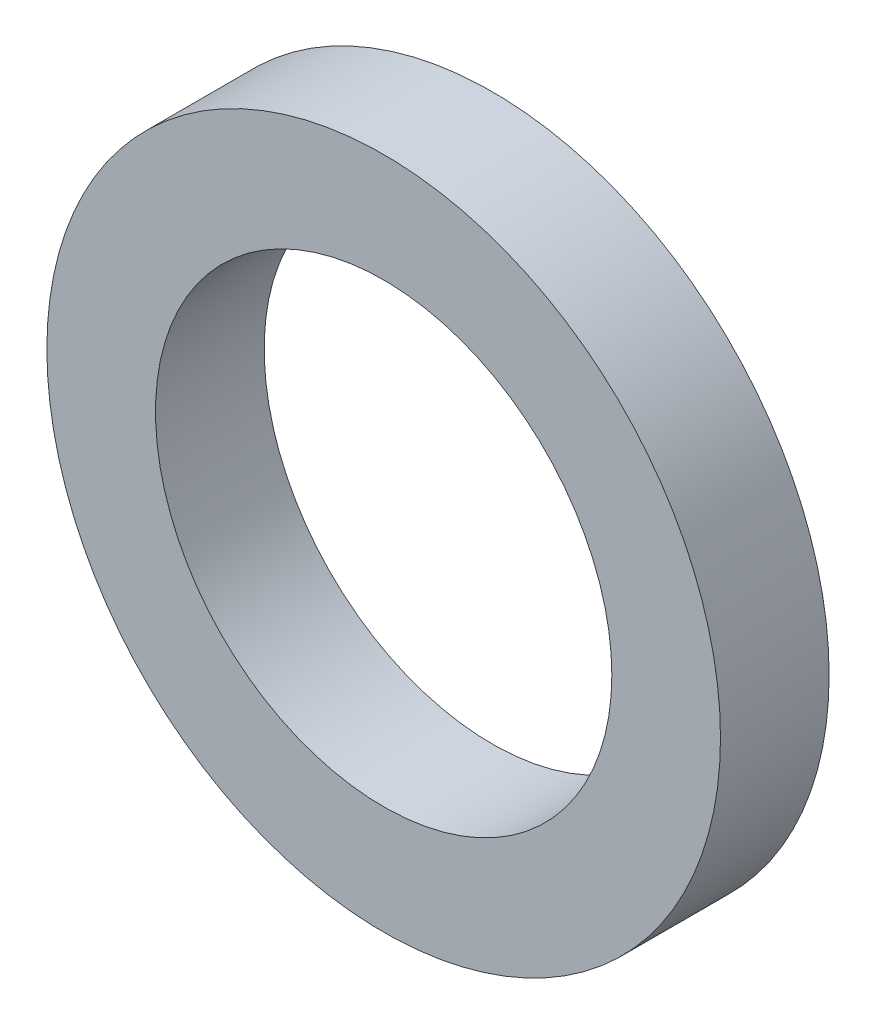
ISO-10303-21;
HEADER;
FILE_DESCRIPTION(('STEP AP214'),'2;1');
FILE_NAME('part.step','',(''),(''),'','','');
FILE_SCHEMA(('AUTOMOTIVE_DESIGN { 1 0 10303 214 1 1 1 1 }'));
ENDSEC;
DATA;
#1=APPLICATION_CONTEXT('core data for automotive mechanical design processes');
#2=APPLICATION_PROTOCOL_DEFINITION('international standard','automotive_design',2000,#1);
#3=PRODUCT_CONTEXT('',#1,'mechanical');
#4=PRODUCT('Part','Part','',(#3));
#5=PRODUCT_RELATED_PRODUCT_CATEGORY('part','',(#4));
#6=PRODUCT_DEFINITION_FORMATION('','',#4);
#7=PRODUCT_DEFINITION_CONTEXT('part definition',#1,'design');
#8=PRODUCT_DEFINITION('design','',#6,#7);
#9=PRODUCT_DEFINITION_SHAPE('','',#8);
#10=(LENGTH_UNIT() NAMED_UNIT(*) SI_UNIT(.MILLI.,.METRE.));
#11=(NAMED_UNIT(*) PLANE_ANGLE_UNIT() SI_UNIT($,.RADIAN.));
#12=(NAMED_UNIT(*) SI_UNIT($,.STERADIAN.) SOLID_ANGLE_UNIT());
#13=UNCERTAINTY_MEASURE_WITH_UNIT(LENGTH_MEASURE(1.E-05),#10,'distance_accuracy_value','');
#14=(GEOMETRIC_REPRESENTATION_CONTEXT(3) GLOBAL_UNCERTAINTY_ASSIGNED_CONTEXT((#13)) GLOBAL_UNIT_ASSIGNED_CONTEXT((#10,
#11,#12)) REPRESENTATION_CONTEXT('',''));
#15=CARTESIAN_POINT('',(0.,0.,0.));
#16=DIRECTION('',(0.,0.,1.));
#17=DIRECTION('',(1.,0.,0.));
#18=AXIS2_PLACEMENT_3D('',#15,#16,#17);
#19=CARTESIAN_POINT('',(0.,0.,1.));
#20=DIRECTION('',(0.,0.,1.));
#21=DIRECTION('',(1.,0.,0.));
#22=AXIS2_PLACEMENT_3D('',#19,#20,#21);
#23=PLANE('',#22);
#24=CARTESIAN_POINT('',(0.,0.,1.));
#25=DIRECTION('',(0.,0.,1.));
#26=DIRECTION('',(1.,0.,0.));
#27=AXIS2_PLACEMENT_3D('',#24,#25,#26);
#28=CIRCLE('',#27,3.1);
#29=CARTESIAN_POINT('',(3.1,0.,1.));
#30=VERTEX_POINT('',#29);
#31=EDGE_CURVE('E10',#30,#30,#28,.T.);
#32=ORIENTED_EDGE('',*,*,#31,.T.);
#33=EDGE_LOOP('',(#32));
#34=FACE_BOUND('',#33,.T.);
#35=CARTESIAN_POINT('',(0.,0.,1.));
#36=DIRECTION('',(0.,0.,1.));
#37=DIRECTION('',(1.,0.,0.));
#38=AXIS2_PLACEMENT_3D('',#35,#36,#37);
#39=CIRCLE('',#38,2.1);
#40=CARTESIAN_POINT('',(2.1,0.,1.));
#41=VERTEX_POINT('',#40);
#42=EDGE_CURVE('E42',#41,#41,#39,.T.);
#43=ORIENTED_EDGE('',*,*,#42,.F.);
#44=EDGE_LOOP('',(#43));
#45=FACE_BOUND('',#44,.T.);
#46=ADVANCED_FACE('F31',(#34,#45),#23,.T.);
#47=CARTESIAN_POINT('',(0.,0.,0.));
#48=DIRECTION('',(0.,0.,1.));
#49=DIRECTION('',(1.,0.,0.));
#50=AXIS2_PLACEMENT_3D('',#47,#48,#49);
#51=PLANE('',#50);
#52=CARTESIAN_POINT('',(0.,0.,0.));
#53=DIRECTION('',(0.,0.,1.));
#54=DIRECTION('',(1.,0.,0.));
#55=AXIS2_PLACEMENT_3D('',#52,#53,#54);
#56=CIRCLE('',#55,3.1);
#57=CARTESIAN_POINT('',(3.1,0.,0.));
#58=VERTEX_POINT('',#57);
#59=EDGE_CURVE('E35',#58,#58,#56,.T.);
#60=ORIENTED_EDGE('',*,*,#59,.F.);
#61=EDGE_LOOP('',(#60));
#62=FACE_BOUND('',#61,.T.);
#63=CARTESIAN_POINT('',(0.,0.,0.));
#64=DIRECTION('',(0.,0.,1.));
#65=DIRECTION('',(1.,0.,0.));
#66=AXIS2_PLACEMENT_3D('',#63,#64,#65);
#67=CIRCLE('',#66,2.1);
#68=CARTESIAN_POINT('',(2.1,0.,0.));
#69=VERTEX_POINT('',#68);
#70=EDGE_CURVE('E44',#69,#69,#67,.T.);
#71=ORIENTED_EDGE('',*,*,#70,.T.);
#72=EDGE_LOOP('',(#71));
#73=FACE_BOUND('',#72,.T.);
#74=ADVANCED_FACE('F54',(#62,#73),#51,.F.);
#75=CARTESIAN_POINT('',(0.,0.,1.));
#76=DIRECTION('',(0.,0.,-1.));
#77=DIRECTION('',(-1.,0.,0.));
#78=AXIS2_PLACEMENT_3D('',#75,#76,#77);
#79=CYLINDRICAL_SURFACE('',#78,3.1);
#80=ORIENTED_EDGE('',*,*,#31,.F.);
#81=EDGE_LOOP('',(#80));
#82=FACE_BOUND('',#81,.T.);
#83=ORIENTED_EDGE('',*,*,#59,.T.);
#84=EDGE_LOOP('',(#83));
#85=FACE_BOUND('',#84,.T.);
#86=ADVANCED_FACE('F33',(#82,#85),#79,.T.);
#87=CARTESIAN_POINT('',(0.,0.,1.));
#88=DIRECTION('',(0.,0.,-1.));
#89=DIRECTION('',(-1.,0.,0.));
#90=AXIS2_PLACEMENT_3D('',#87,#88,#89);
#91=CYLINDRICAL_SURFACE('',#90,2.1);
#92=ORIENTED_EDGE('',*,*,#42,.T.);
#93=EDGE_LOOP('',(#92));
#94=FACE_BOUND('',#93,.T.);
#95=ORIENTED_EDGE('',*,*,#70,.F.);
#96=EDGE_LOOP('',(#95));
#97=FACE_BOUND('',#96,.T.);
#98=ADVANCED_FACE('F50',(#94,#97),#91,.F.);
#99=CLOSED_SHELL('',(#46,#74,#86,#98));
#100=MANIFOLD_SOLID_BREP('B2',#99);
#101=ADVANCED_BREP_SHAPE_REPRESENTATION('',(#18,#100),#14);
#102=SHAPE_DEFINITION_REPRESENTATION(#9,#101);
ENDSEC;
END-ISO-10303-21;
